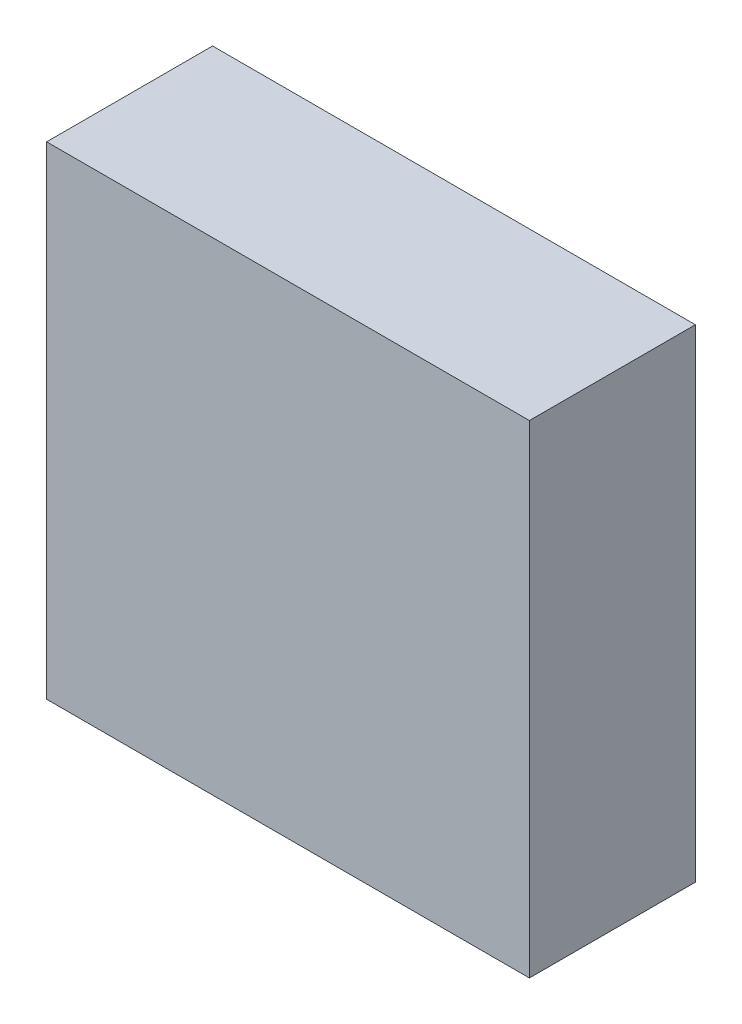
ISO-10303-21;
HEADER;
FILE_DESCRIPTION(('STEP AP214'),'2;1');
FILE_NAME('part.step','',(''),(''),'','','');
FILE_SCHEMA(('AUTOMOTIVE_DESIGN { 1 0 10303 214 1 1 1 1 }'));
ENDSEC;
DATA;
#1=APPLICATION_CONTEXT('core data for automotive mechanical design processes');
#2=APPLICATION_PROTOCOL_DEFINITION('international standard','automotive_design',2000,#1);
#3=PRODUCT_CONTEXT('',#1,'mechanical');
#4=PRODUCT('Part','Part','',(#3));
#5=PRODUCT_RELATED_PRODUCT_CATEGORY('part','',(#4));
#6=PRODUCT_DEFINITION_FORMATION('','',#4);
#7=PRODUCT_DEFINITION_CONTEXT('part definition',#1,'design');
#8=PRODUCT_DEFINITION('design','',#6,#7);
#9=PRODUCT_DEFINITION_SHAPE('','',#8);
#10=(LENGTH_UNIT() NAMED_UNIT(*) SI_UNIT(.MILLI.,.METRE.));
#11=(NAMED_UNIT(*) PLANE_ANGLE_UNIT() SI_UNIT($,.RADIAN.));
#12=(NAMED_UNIT(*) SI_UNIT($,.STERADIAN.) SOLID_ANGLE_UNIT());
#13=UNCERTAINTY_MEASURE_WITH_UNIT(LENGTH_MEASURE(1.E-05),#10,'distance_accuracy_value','');
#14=(GEOMETRIC_REPRESENTATION_CONTEXT(3) GLOBAL_UNCERTAINTY_ASSIGNED_CONTEXT((#13)) GLOBAL_UNIT_ASSIGNED_CONTEXT((#10,
#11,#12)) REPRESENTATION_CONTEXT('',''));
#15=CARTESIAN_POINT('',(0.,0.,0.));
#16=DIRECTION('',(0.,0.,1.));
#17=DIRECTION('',(1.,0.,0.));
#18=AXIS2_PLACEMENT_3D('',#15,#16,#17);
#19=CARTESIAN_POINT('',(1.59999934,1.60000188,1.10000034));
#20=DIRECTION('',(0.,0.,1.));
#21=DIRECTION('',(1.,0.,0.));
#22=AXIS2_PLACEMENT_3D('',#19,#20,#21);
#23=PLANE('',#22);
#24=DIRECTION('',(1.,0.,0.));
#25=VECTOR('',#24,1.);
#26=CARTESIAN_POINT('',(1.59999934,-1.59999934,1.10000034));
#27=LINE('',#26,#25);
#28=CARTESIAN_POINT('',(1.59999934,-1.59999934,1.10000034));
#29=VERTEX_POINT('',#28);
#30=CARTESIAN_POINT('',(-1.59999934,-1.59999934,1.10000034));
#31=VERTEX_POINT('',#30);
#32=EDGE_CURVE('E53',#29,#31,#27,.F.);
#33=ORIENTED_EDGE('',*,*,#32,.F.);
#34=DIRECTION('',(0.,1.,0.));
#35=VECTOR('',#34,1.);
#36=CARTESIAN_POINT('',(1.59999934,1.60000188,1.10000034));
#37=LINE('',#36,#35);
#38=CARTESIAN_POINT('',(1.59999934,1.60000188,1.10000034));
#39=VERTEX_POINT('',#38);
#40=EDGE_CURVE('E68',#39,#29,#37,.F.);
#41=ORIENTED_EDGE('',*,*,#40,.F.);
#42=DIRECTION('',(1.,0.,0.));
#43=VECTOR('',#42,1.);
#44=CARTESIAN_POINT('',(-1.59999934,1.60000188,1.10000034));
#45=LINE('',#44,#43);
#46=CARTESIAN_POINT('',(-1.59999934,1.60000188,1.10000034));
#47=VERTEX_POINT('',#46);
#48=EDGE_CURVE('E20',#47,#39,#45,.T.);
#49=ORIENTED_EDGE('',*,*,#48,.F.);
#50=DIRECTION('',(0.,1.,0.));
#51=VECTOR('',#50,1.);
#52=CARTESIAN_POINT('',(-1.59999934,-1.59999934,1.10000034));
#53=LINE('',#52,#51);
#54=EDGE_CURVE('E58',#31,#47,#53,.T.);
#55=ORIENTED_EDGE('',*,*,#54,.F.);
#56=EDGE_LOOP('',(#33,#41,#49,#55));
#57=FACE_BOUND('',#56,.T.);
#58=ADVANCED_FACE('F17',(#57),#23,.T.);
#59=CARTESIAN_POINT('',(-1.59999934,1.60000188,0.));
#60=DIRECTION('',(0.,1.,0.));
#61=DIRECTION('',(0.,0.,1.));
#62=AXIS2_PLACEMENT_3D('',#59,#60,#61);
#63=PLANE('',#62);
#64=DIRECTION('',(0.,0.,-1.));
#65=VECTOR('',#64,1.);
#66=CARTESIAN_POINT('',(1.59999934,1.60000188,0.));
#67=LINE('',#66,#65);
#68=CARTESIAN_POINT('',(1.59999934,1.60000188,0.));
#69=VERTEX_POINT('',#68);
#70=EDGE_CURVE('E79',#69,#39,#67,.F.);
#71=ORIENTED_EDGE('',*,*,#70,.F.);
#72=DIRECTION('',(1.,0.,0.));
#73=VECTOR('',#72,1.);
#74=CARTESIAN_POINT('',(1.59999934,1.60000188,0.));
#75=LINE('',#74,#73);
#76=CARTESIAN_POINT('',(-1.59999934,1.60000188,0.));
#77=VERTEX_POINT('',#76);
#78=EDGE_CURVE('E74',#69,#77,#75,.F.);
#79=ORIENTED_EDGE('',*,*,#78,.T.);
#80=DIRECTION('',(0.,0.,1.));
#81=VECTOR('',#80,1.);
#82=CARTESIAN_POINT('',(-1.59999934,1.60000188,0.));
#83=LINE('',#82,#81);
#84=EDGE_CURVE('E63',#47,#77,#83,.F.);
#85=ORIENTED_EDGE('',*,*,#84,.F.);
#86=ORIENTED_EDGE('',*,*,#48,.T.);
#87=EDGE_LOOP('',(#71,#79,#85,#86));
#88=FACE_BOUND('',#87,.T.);
#89=ADVANCED_FACE('F73',(#88),#63,.T.);
#90=CARTESIAN_POINT('',(-1.59999934,-1.59999934,0.));
#91=DIRECTION('',(-1.,0.,0.));
#92=DIRECTION('',(0.,0.,1.));
#93=AXIS2_PLACEMENT_3D('',#90,#91,#92);
#94=PLANE('',#93);
#95=ORIENTED_EDGE('',*,*,#84,.T.);
#96=DIRECTION('',(0.,1.,0.));
#97=VECTOR('',#96,1.);
#98=CARTESIAN_POINT('',(-1.59999934,1.60000188,0.));
#99=LINE('',#98,#97);
#100=CARTESIAN_POINT('',(-1.59999934,-1.59999934,0.));
#101=VERTEX_POINT('',#100);
#102=EDGE_CURVE('E84',#77,#101,#99,.F.);
#103=ORIENTED_EDGE('',*,*,#102,.T.);
#104=DIRECTION('',(0.,0.,-1.));
#105=VECTOR('',#104,1.);
#106=CARTESIAN_POINT('',(-1.59999934,-1.59999934,0.));
#107=LINE('',#106,#105);
#108=EDGE_CURVE('E65',#31,#101,#107,.T.);
#109=ORIENTED_EDGE('',*,*,#108,.F.);
#110=ORIENTED_EDGE('',*,*,#54,.T.);
#111=EDGE_LOOP('',(#95,#103,#109,#110));
#112=FACE_BOUND('',#111,.T.);
#113=ADVANCED_FACE('F60',(#112),#94,.T.);
#114=CARTESIAN_POINT('',(1.59999934,-1.59999934,0.));
#115=DIRECTION('',(0.,-1.,0.));
#116=DIRECTION('',(0.,0.,-1.));
#117=AXIS2_PLACEMENT_3D('',#114,#115,#116);
#118=PLANE('',#117);
#119=ORIENTED_EDGE('',*,*,#108,.T.);
#120=DIRECTION('',(1.,0.,0.));
#121=VECTOR('',#120,1.);
#122=CARTESIAN_POINT('',(1.59999934,-1.59999934,0.));
#123=LINE('',#122,#121);
#124=CARTESIAN_POINT('',(1.59999934,-1.59999934,0.));
#125=VERTEX_POINT('',#124);
#126=EDGE_CURVE('E26',#101,#125,#123,.T.);
#127=ORIENTED_EDGE('',*,*,#126,.T.);
#128=DIRECTION('',(0.,0.,-1.));
#129=VECTOR('',#128,1.);
#130=CARTESIAN_POINT('',(1.59999934,-1.59999934,0.));
#131=LINE('',#130,#129);
#132=EDGE_CURVE('E34',#29,#125,#131,.T.);
#133=ORIENTED_EDGE('',*,*,#132,.F.);
#134=ORIENTED_EDGE('',*,*,#32,.T.);
#135=EDGE_LOOP('',(#119,#127,#133,#134));
#136=FACE_BOUND('',#135,.T.);
#137=ADVANCED_FACE('F88',(#136),#118,.T.);
#138=CARTESIAN_POINT('',(1.59999934,1.60000188,0.));
#139=DIRECTION('',(1.,0.,0.));
#140=DIRECTION('',(0.,0.,-1.));
#141=AXIS2_PLACEMENT_3D('',#138,#139,#140);
#142=PLANE('',#141);
#143=ORIENTED_EDGE('',*,*,#132,.T.);
#144=DIRECTION('',(0.,1.,0.));
#145=VECTOR('',#144,1.);
#146=CARTESIAN_POINT('',(1.59999934,1.60000188,0.));
#147=LINE('',#146,#145);
#148=EDGE_CURVE('E11',#125,#69,#147,.T.);
#149=ORIENTED_EDGE('',*,*,#148,.T.);
#150=ORIENTED_EDGE('',*,*,#70,.T.);
#151=ORIENTED_EDGE('',*,*,#40,.T.);
#152=EDGE_LOOP('',(#143,#149,#150,#151));
#153=FACE_BOUND('',#152,.T.);
#154=ADVANCED_FACE('F91',(#153),#142,.T.);
#155=CARTESIAN_POINT('',(1.59999934,1.60000188,0.));
#156=DIRECTION('',(0.,0.,1.));
#157=DIRECTION('',(1.,0.,0.));
#158=AXIS2_PLACEMENT_3D('',#155,#156,#157);
#159=PLANE('',#158);
#160=ORIENTED_EDGE('',*,*,#126,.F.);
#161=ORIENTED_EDGE('',*,*,#102,.F.);
#162=ORIENTED_EDGE('',*,*,#78,.F.);
#163=ORIENTED_EDGE('',*,*,#148,.F.);
#164=EDGE_LOOP('',(#160,#161,#162,#163));
#165=FACE_BOUND('',#164,.T.);
#166=ADVANCED_FACE('F90',(#165),#159,.F.);
#167=CLOSED_SHELL('',(#58,#89,#113,#137,#154,#166));
#168=MANIFOLD_SOLID_BREP('B1',#167);
#169=ADVANCED_BREP_SHAPE_REPRESENTATION('',(#18,#168),#14);
#170=SHAPE_DEFINITION_REPRESENTATION(#9,#169);
ENDSEC;
END-ISO-10303-21;
